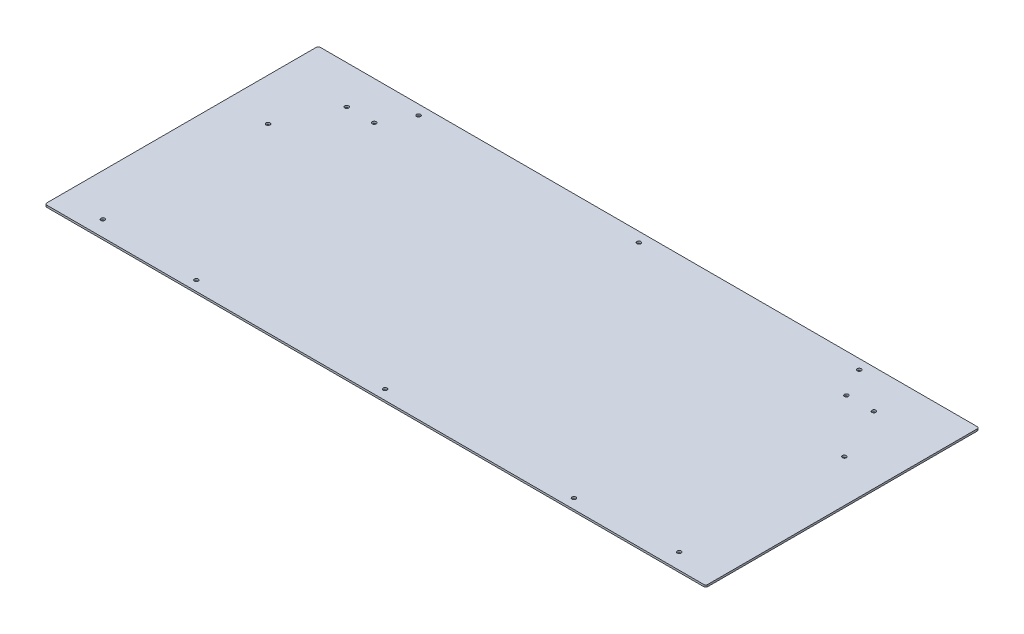
ISO-10303-21;
HEADER;
FILE_DESCRIPTION(('STEP AP214'),'2;1');
FILE_NAME('part.step','',(''),(''),'','','');
FILE_SCHEMA(('AUTOMOTIVE_DESIGN { 1 0 10303 214 1 1 1 1 }'));
ENDSEC;
DATA;
#1=APPLICATION_CONTEXT('core data for automotive mechanical design processes');
#2=APPLICATION_PROTOCOL_DEFINITION('international standard','automotive_design',2000,#1);
#3=PRODUCT_CONTEXT('',#1,'mechanical');
#4=PRODUCT('Part','Part','',(#3));
#5=PRODUCT_RELATED_PRODUCT_CATEGORY('part','',(#4));
#6=PRODUCT_DEFINITION_FORMATION('','',#4);
#7=PRODUCT_DEFINITION_CONTEXT('part definition',#1,'design');
#8=PRODUCT_DEFINITION('design','',#6,#7);
#9=PRODUCT_DEFINITION_SHAPE('','',#8);
#10=(LENGTH_UNIT() NAMED_UNIT(*) SI_UNIT(.MILLI.,.METRE.));
#11=(NAMED_UNIT(*) PLANE_ANGLE_UNIT() SI_UNIT($,.RADIAN.));
#12=(NAMED_UNIT(*) SI_UNIT($,.STERADIAN.) SOLID_ANGLE_UNIT());
#13=UNCERTAINTY_MEASURE_WITH_UNIT(LENGTH_MEASURE(1.E-05),#10,'distance_accuracy_value','');
#14=(GEOMETRIC_REPRESENTATION_CONTEXT(3) GLOBAL_UNCERTAINTY_ASSIGNED_CONTEXT((#13)) GLOBAL_UNIT_ASSIGNED_CONTEXT((#10,
#11,#12)) REPRESENTATION_CONTEXT('',''));
#15=CARTESIAN_POINT('',(0.,0.,0.));
#16=DIRECTION('',(0.,0.,1.));
#17=DIRECTION('',(1.,0.,0.));
#18=AXIS2_PLACEMENT_3D('',#15,#16,#17);
#19=CARTESIAN_POINT('',(0.,0.,0.));
#20=DIRECTION('',(0.,-1.,0.));
#21=DIRECTION('',(0.,0.,-1.));
#22=AXIS2_PLACEMENT_3D('',#19,#20,#21);
#23=PLANE('',#22);
#24=CARTESIAN_POINT('',(228.6,0.,-15.875));
#25=DIRECTION('',(0.,1.,0.));
#26=DIRECTION('',(0.,0.,1.));
#27=AXIS2_PLACEMENT_3D('',#24,#25,#26);
#28=CIRCLE('',#27,3.17499999999998);
#29=CARTESIAN_POINT('',(228.6,0.,-12.7));
#30=VERTEX_POINT('',#29);
#31=EDGE_CURVE('E250',#30,#30,#28,.T.);
#32=ORIENTED_EDGE('',*,*,#31,.T.);
#33=EDGE_LOOP('',(#32));
#34=FACE_BOUND('',#33,.T.);
#35=CARTESIAN_POINT('',(533.4,0.,-15.875));
#36=DIRECTION('',(0.,1.,0.));
#37=DIRECTION('',(0.,0.,1.));
#38=AXIS2_PLACEMENT_3D('',#35,#36,#37);
#39=CIRCLE('',#38,3.17500000000004);
#40=CARTESIAN_POINT('',(533.4,0.,-12.7));
#41=VERTEX_POINT('',#40);
#42=EDGE_CURVE('E244',#41,#41,#39,.T.);
#43=ORIENTED_EDGE('',*,*,#42,.T.);
#44=EDGE_LOOP('',(#43));
#45=FACE_BOUND('',#44,.T.);
#46=CARTESIAN_POINT('',(838.2,0.,-15.8750000000001));
#47=DIRECTION('',(0.,1.,0.));
#48=DIRECTION('',(0.,0.,1.));
#49=AXIS2_PLACEMENT_3D('',#46,#47,#48);
#50=CIRCLE('',#49,3.17500000000004);
#51=CARTESIAN_POINT('',(838.2,0.,-12.7000000000001));
#52=VERTEX_POINT('',#51);
#53=EDGE_CURVE('E238',#52,#52,#50,.T.);
#54=ORIENTED_EDGE('',*,*,#53,.T.);
#55=EDGE_LOOP('',(#54));
#56=FACE_BOUND('',#55,.T.);
#57=CARTESIAN_POINT('',(889.,0.,-425.45));
#58=DIRECTION('',(0.,1.,0.));
#59=DIRECTION('',(0.,0.,1.));
#60=AXIS2_PLACEMENT_3D('',#57,#58,#59);
#61=CIRCLE('',#60,3.17500000000004);
#62=CARTESIAN_POINT('',(889.,0.,-422.275));
#63=VERTEX_POINT('',#62);
#64=EDGE_CURVE('E232',#63,#63,#61,.T.);
#65=ORIENTED_EDGE('',*,*,#64,.T.);
#66=EDGE_LOOP('',(#65));
#67=FACE_BOUND('',#66,.T.);
#68=CARTESIAN_POINT('',(533.4,0.,-425.45));
#69=DIRECTION('',(0.,1.,0.));
#70=DIRECTION('',(0.,0.,1.));
#71=AXIS2_PLACEMENT_3D('',#68,#69,#70);
#72=CIRCLE('',#71,3.17500000000004);
#73=CARTESIAN_POINT('',(533.4,0.,-422.275));
#74=VERTEX_POINT('',#73);
#75=EDGE_CURVE('E226',#74,#74,#72,.T.);
#76=ORIENTED_EDGE('',*,*,#75,.T.);
#77=EDGE_LOOP('',(#76));
#78=FACE_BOUND('',#77,.T.);
#79=CARTESIAN_POINT('',(177.8,0.,-425.45));
#80=DIRECTION('',(0.,1.,0.));
#81=DIRECTION('',(0.,0.,1.));
#82=AXIS2_PLACEMENT_3D('',#79,#80,#81);
#83=CIRCLE('',#82,3.17499999999998);
#84=CARTESIAN_POINT('',(177.8,0.,-422.275));
#85=VERTEX_POINT('',#84);
#86=EDGE_CURVE('E220',#85,#85,#83,.T.);
#87=ORIENTED_EDGE('',*,*,#86,.T.);
#88=EDGE_LOOP('',(#87));
#89=FACE_BOUND('',#88,.T.);
#90=CARTESIAN_POINT('',(68.2624999999999,0.,-25.4));
#91=DIRECTION('',(0.,1.,0.));
#92=DIRECTION('',(0.,0.,1.));
#93=AXIS2_PLACEMENT_3D('',#90,#91,#92);
#94=CIRCLE('',#93,3.175);
#95=CARTESIAN_POINT('',(68.2624999999999,0.,-22.225));
#96=VERTEX_POINT('',#95);
#97=EDGE_CURVE('E214',#96,#96,#94,.T.);
#98=ORIENTED_EDGE('',*,*,#97,.T.);
#99=EDGE_LOOP('',(#98));
#100=FACE_BOUND('',#99,.T.);
#101=CARTESIAN_POINT('',(68.2625,0.,-292.1));
#102=DIRECTION('',(0.,1.,0.));
#103=DIRECTION('',(0.,0.,1.));
#104=AXIS2_PLACEMENT_3D('',#101,#102,#103);
#105=CIRCLE('',#104,3.175);
#106=CARTESIAN_POINT('',(68.2625,0.,-288.925));
#107=VERTEX_POINT('',#106);
#108=EDGE_CURVE('E208',#107,#107,#105,.T.);
#109=ORIENTED_EDGE('',*,*,#108,.T.);
#110=EDGE_LOOP('',(#109));
#111=FACE_BOUND('',#110,.T.);
#112=CARTESIAN_POINT('',(998.5375,0.,-25.4000000000001));
#113=DIRECTION('',(0.,1.,0.));
#114=DIRECTION('',(0.,0.,1.));
#115=AXIS2_PLACEMENT_3D('',#112,#113,#114);
#116=CIRCLE('',#115,3.17500000000004);
#117=CARTESIAN_POINT('',(998.5375,0.,-22.225));
#118=VERTEX_POINT('',#117);
#119=EDGE_CURVE('E202',#118,#118,#116,.T.);
#120=ORIENTED_EDGE('',*,*,#119,.T.);
#121=EDGE_LOOP('',(#120));
#122=FACE_BOUND('',#121,.T.);
#123=CARTESIAN_POINT('',(998.5375,0.,-292.1));
#124=DIRECTION('',(0.,1.,0.));
#125=DIRECTION('',(0.,0.,1.));
#126=AXIS2_PLACEMENT_3D('',#123,#124,#125);
#127=CIRCLE('',#126,3.17500000000004);
#128=CARTESIAN_POINT('',(998.5375,0.,-288.925));
#129=VERTEX_POINT('',#128);
#130=EDGE_CURVE('E196',#129,#129,#127,.T.);
#131=ORIENTED_EDGE('',*,*,#130,.T.);
#132=EDGE_LOOP('',(#131));
#133=FACE_BOUND('',#132,.T.);
#134=DIRECTION('',(-1.,0.,0.));
#135=VECTOR('',#134,1.);
#136=CARTESIAN_POINT('',(0.,0.,-441.325));
#137=LINE('',#136,#135);
#138=CARTESIAN_POINT('',(1063.625,0.,-441.325));
#139=VERTEX_POINT('',#138);
#140=CARTESIAN_POINT('',(3.175,0.,-441.325));
#141=VERTEX_POINT('',#140);
#142=EDGE_CURVE('E118',#139,#141,#137,.T.);
#143=ORIENTED_EDGE('',*,*,#142,.F.);
#144=CARTESIAN_POINT('',(1063.625,0.,-438.15));
#145=DIRECTION('',(0.,-1.,0.));
#146=DIRECTION('',(0.,0.,-1.));
#147=AXIS2_PLACEMENT_3D('',#144,#145,#146);
#148=CIRCLE('',#147,3.175);
#149=CARTESIAN_POINT('',(1066.8,0.,-438.15));
#150=VERTEX_POINT('',#149);
#151=EDGE_CURVE('E101',#139,#150,#148,.T.);
#152=ORIENTED_EDGE('',*,*,#151,.T.);
#153=DIRECTION('',(0.,0.,-1.));
#154=VECTOR('',#153,1.);
#155=CARTESIAN_POINT('',(1066.8,0.,0.));
#156=LINE('',#155,#154);
#157=CARTESIAN_POINT('',(1066.8,0.,-3.175));
#158=VERTEX_POINT('',#157);
#159=EDGE_CURVE('E128',#158,#150,#156,.T.);
#160=ORIENTED_EDGE('',*,*,#159,.F.);
#161=CARTESIAN_POINT('',(1063.625,0.,-3.175));
#162=DIRECTION('',(0.,-1.,0.));
#163=DIRECTION('',(0.,0.,-1.));
#164=AXIS2_PLACEMENT_3D('',#161,#162,#163);
#165=CIRCLE('',#164,3.175);
#166=CARTESIAN_POINT('',(1063.625,0.,0.));
#167=VERTEX_POINT('',#166);
#168=EDGE_CURVE('E112',#158,#167,#165,.T.);
#169=ORIENTED_EDGE('',*,*,#168,.T.);
#170=DIRECTION('',(1.,0.,0.));
#171=VECTOR('',#170,1.);
#172=CARTESIAN_POINT('',(0.,0.,0.));
#173=LINE('',#172,#171);
#174=CARTESIAN_POINT('',(3.175,0.,0.));
#175=VERTEX_POINT('',#174);
#176=EDGE_CURVE('E132',#175,#167,#173,.T.);
#177=ORIENTED_EDGE('',*,*,#176,.F.);
#178=CARTESIAN_POINT('',(3.175,0.,-3.175));
#179=DIRECTION('',(0.,-1.,0.));
#180=DIRECTION('',(0.,0.,-1.));
#181=AXIS2_PLACEMENT_3D('',#178,#179,#180);
#182=CIRCLE('',#181,3.175);
#183=CARTESIAN_POINT('',(0.,0.,-3.175));
#184=VERTEX_POINT('',#183);
#185=EDGE_CURVE('E138',#175,#184,#182,.T.);
#186=ORIENTED_EDGE('',*,*,#185,.T.);
#187=DIRECTION('',(0.,0.,1.));
#188=VECTOR('',#187,1.);
#189=CARTESIAN_POINT('',(0.,0.,0.));
#190=LINE('',#189,#188);
#191=CARTESIAN_POINT('',(0.,0.,-438.15));
#192=VERTEX_POINT('',#191);
#193=EDGE_CURVE('E160',#192,#184,#190,.T.);
#194=ORIENTED_EDGE('',*,*,#193,.F.);
#195=CARTESIAN_POINT('',(3.175,0.,-438.15));
#196=DIRECTION('',(0.,-1.,0.));
#197=DIRECTION('',(0.,0.,-1.));
#198=AXIS2_PLACEMENT_3D('',#195,#196,#197);
#199=CIRCLE('',#198,3.175);
#200=EDGE_CURVE('E122',#192,#141,#199,.T.);
#201=ORIENTED_EDGE('',*,*,#200,.T.);
#202=EDGE_LOOP('',(#143,#152,#160,#169,#177,#186,#194,#201));
#203=FACE_BOUND('',#202,.T.);
#204=CARTESIAN_POINT('',(152.4,0.,-379.3744));
#205=DIRECTION('',(0.,1.,0.));
#206=DIRECTION('',(0.,0.,1.));
#207=AXIS2_PLACEMENT_3D('',#204,#205,#206);
#208=CIRCLE('',#207,3.17499999999998);
#209=CARTESIAN_POINT('',(152.4,0.,-376.1994));
#210=VERTEX_POINT('',#209);
#211=EDGE_CURVE('E165',#210,#210,#208,.T.);
#212=ORIENTED_EDGE('',*,*,#211,.T.);
#213=EDGE_LOOP('',(#212));
#214=FACE_BOUND('',#213,.T.);
#215=CARTESIAN_POINT('',(107.95,0.,-379.3744));
#216=DIRECTION('',(0.,1.,0.));
#217=DIRECTION('',(0.,0.,1.));
#218=AXIS2_PLACEMENT_3D('',#215,#216,#217);
#219=CIRCLE('',#218,3.175);
#220=CARTESIAN_POINT('',(107.95,0.,-376.1994));
#221=VERTEX_POINT('',#220);
#222=EDGE_CURVE('E178',#221,#221,#219,.T.);
#223=ORIENTED_EDGE('',*,*,#222,.T.);
#224=EDGE_LOOP('',(#223));
#225=FACE_BOUND('',#224,.T.);
#226=CARTESIAN_POINT('',(914.4,0.,-379.3744));
#227=DIRECTION('',(0.,1.,0.));
#228=DIRECTION('',(0.,0.,1.));
#229=AXIS2_PLACEMENT_3D('',#226,#227,#228);
#230=CIRCLE('',#229,3.17500000000004);
#231=CARTESIAN_POINT('',(914.4,0.,-376.1994));
#232=VERTEX_POINT('',#231);
#233=EDGE_CURVE('E184',#232,#232,#230,.T.);
#234=ORIENTED_EDGE('',*,*,#233,.T.);
#235=EDGE_LOOP('',(#234));
#236=FACE_BOUND('',#235,.T.);
#237=CARTESIAN_POINT('',(958.85,0.,-379.3744));
#238=DIRECTION('',(0.,1.,0.));
#239=DIRECTION('',(0.,0.,1.));
#240=AXIS2_PLACEMENT_3D('',#237,#238,#239);
#241=CIRCLE('',#240,3.17500000000004);
#242=CARTESIAN_POINT('',(958.85,0.,-376.1994));
#243=VERTEX_POINT('',#242);
#244=EDGE_CURVE('E190',#243,#243,#241,.T.);
#245=ORIENTED_EDGE('',*,*,#244,.T.);
#246=EDGE_LOOP('',(#245));
#247=FACE_BOUND('',#246,.T.);
#248=ADVANCED_FACE('F35',(#34,#45,#56,#67,#78,#89,#100,#111,#122,#133,#203,#214,#225,#236,#247),
#23,.T.);
#249=CARTESIAN_POINT('',(0.,3.175,0.));
#250=DIRECTION('',(1.,0.,0.));
#251=DIRECTION('',(0.,0.,-1.));
#252=AXIS2_PLACEMENT_3D('',#249,#250,#251);
#253=PLANE('',#252);
#254=ORIENTED_EDGE('',*,*,#193,.T.);
#255=DIRECTION('',(0.,-1.,0.));
#256=VECTOR('',#255,1.);
#257=CARTESIAN_POINT('',(0.,3.175,-3.175));
#258=LINE('',#257,#256);
#259=CARTESIAN_POINT('',(0.,3.175,-3.175));
#260=VERTEX_POINT('',#259);
#261=EDGE_CURVE('E11',#184,#260,#258,.F.);
#262=ORIENTED_EDGE('',*,*,#261,.T.);
#263=DIRECTION('',(0.,0.,1.));
#264=VECTOR('',#263,1.);
#265=CARTESIAN_POINT('',(0.,3.175,0.));
#266=LINE('',#265,#264);
#267=CARTESIAN_POINT('',(0.,3.175,-438.15));
#268=VERTEX_POINT('',#267);
#269=EDGE_CURVE('E127',#268,#260,#266,.T.);
#270=ORIENTED_EDGE('',*,*,#269,.F.);
#271=DIRECTION('',(0.,-1.,0.));
#272=VECTOR('',#271,1.);
#273=CARTESIAN_POINT('',(0.,3.175,-438.15));
#274=LINE('',#273,#272);
#275=EDGE_CURVE('E43',#268,#192,#274,.T.);
#276=ORIENTED_EDGE('',*,*,#275,.T.);
#277=EDGE_LOOP('',(#254,#262,#270,#276));
#278=FACE_BOUND('',#277,.T.);
#279=ADVANCED_FACE('F159',(#278),#253,.F.);
#280=CARTESIAN_POINT('',(0.,3.175,0.));
#281=DIRECTION('',(0.,0.,-1.));
#282=DIRECTION('',(-1.,0.,0.));
#283=AXIS2_PLACEMENT_3D('',#280,#281,#282);
#284=PLANE('',#283);
#285=ORIENTED_EDGE('',*,*,#176,.T.);
#286=DIRECTION('',(0.,-1.,0.));
#287=VECTOR('',#286,1.);
#288=CARTESIAN_POINT('',(1063.625,3.175,0.));
#289=LINE('',#288,#287);
#290=CARTESIAN_POINT('',(1063.625,3.175,0.));
#291=VERTEX_POINT('',#290);
#292=EDGE_CURVE('E50',#167,#291,#289,.F.);
#293=ORIENTED_EDGE('',*,*,#292,.T.);
#294=DIRECTION('',(1.,0.,0.));
#295=VECTOR('',#294,1.);
#296=CARTESIAN_POINT('',(0.,3.175,0.));
#297=LINE('',#296,#295);
#298=CARTESIAN_POINT('',(3.175,3.175,0.));
#299=VERTEX_POINT('',#298);
#300=EDGE_CURVE('E130',#299,#291,#297,.T.);
#301=ORIENTED_EDGE('',*,*,#300,.F.);
#302=DIRECTION('',(0.,-1.,0.));
#303=VECTOR('',#302,1.);
#304=CARTESIAN_POINT('',(3.175,3.175,0.));
#305=LINE('',#304,#303);
#306=EDGE_CURVE('E151',#299,#175,#305,.T.);
#307=ORIENTED_EDGE('',*,*,#306,.T.);
#308=EDGE_LOOP('',(#285,#293,#301,#307));
#309=FACE_BOUND('',#308,.T.);
#310=ADVANCED_FACE('F296',(#309),#284,.F.);
#311=CARTESIAN_POINT('',(1066.8,3.175,0.));
#312=DIRECTION('',(-1.,0.,0.));
#313=DIRECTION('',(0.,0.,1.));
#314=AXIS2_PLACEMENT_3D('',#311,#312,#313);
#315=PLANE('',#314);
#316=ORIENTED_EDGE('',*,*,#159,.T.);
#317=DIRECTION('',(0.,-1.,0.));
#318=VECTOR('',#317,1.);
#319=CARTESIAN_POINT('',(1066.8,3.175,-438.15));
#320=LINE('',#319,#318);
#321=CARTESIAN_POINT('',(1066.8,3.175,-438.15));
#322=VERTEX_POINT('',#321);
#323=EDGE_CURVE('E106',#150,#322,#320,.F.);
#324=ORIENTED_EDGE('',*,*,#323,.T.);
#325=DIRECTION('',(0.,0.,-1.));
#326=VECTOR('',#325,1.);
#327=CARTESIAN_POINT('',(1066.8,3.175,0.));
#328=LINE('',#327,#326);
#329=CARTESIAN_POINT('',(1066.8,3.175,-3.175));
#330=VERTEX_POINT('',#329);
#331=EDGE_CURVE('E172',#330,#322,#328,.T.);
#332=ORIENTED_EDGE('',*,*,#331,.F.);
#333=DIRECTION('',(0.,-1.,0.));
#334=VECTOR('',#333,1.);
#335=CARTESIAN_POINT('',(1066.8,3.175,-3.175));
#336=LINE('',#335,#334);
#337=EDGE_CURVE('E111',#330,#158,#336,.T.);
#338=ORIENTED_EDGE('',*,*,#337,.T.);
#339=EDGE_LOOP('',(#316,#324,#332,#338));
#340=FACE_BOUND('',#339,.T.);
#341=ADVANCED_FACE('F293',(#340),#315,.F.);
#342=CARTESIAN_POINT('',(0.,3.175,-441.325));
#343=DIRECTION('',(0.,0.,1.));
#344=DIRECTION('',(1.,0.,0.));
#345=AXIS2_PLACEMENT_3D('',#342,#343,#344);
#346=PLANE('',#345);
#347=DIRECTION('',(-1.,0.,0.));
#348=VECTOR('',#347,1.);
#349=CARTESIAN_POINT('',(0.,3.175,-441.325));
#350=LINE('',#349,#348);
#351=CARTESIAN_POINT('',(1063.625,3.175,-441.325));
#352=VERTEX_POINT('',#351);
#353=CARTESIAN_POINT('',(3.175,3.175,-441.325));
#354=VERTEX_POINT('',#353);
#355=EDGE_CURVE('E121',#352,#354,#350,.T.);
#356=ORIENTED_EDGE('',*,*,#355,.F.);
#357=DIRECTION('',(0.,-1.,0.));
#358=VECTOR('',#357,1.);
#359=CARTESIAN_POINT('',(1063.625,3.175,-441.325));
#360=LINE('',#359,#358);
#361=EDGE_CURVE('E105',#352,#139,#360,.T.);
#362=ORIENTED_EDGE('',*,*,#361,.T.);
#363=ORIENTED_EDGE('',*,*,#142,.T.);
#364=DIRECTION('',(0.,-1.,0.));
#365=VECTOR('',#364,1.);
#366=CARTESIAN_POINT('',(3.175,3.175,-441.325));
#367=LINE('',#366,#365);
#368=EDGE_CURVE('E123',#141,#354,#367,.F.);
#369=ORIENTED_EDGE('',*,*,#368,.T.);
#370=EDGE_LOOP('',(#356,#362,#363,#369));
#371=FACE_BOUND('',#370,.T.);
#372=ADVANCED_FACE('F117',(#371),#346,.F.);
#373=CARTESIAN_POINT('',(0.,3.175,0.));
#374=DIRECTION('',(0.,-1.,0.));
#375=DIRECTION('',(0.,0.,-1.));
#376=AXIS2_PLACEMENT_3D('',#373,#374,#375);
#377=PLANE('',#376);
#378=CARTESIAN_POINT('',(228.6,3.175,-15.875));
#379=DIRECTION('',(0.,1.,0.));
#380=DIRECTION('',(0.,0.,1.));
#381=AXIS2_PLACEMENT_3D('',#378,#379,#380);
#382=CIRCLE('',#381,3.17499999999998);
#383=CARTESIAN_POINT('',(228.6,3.175,-12.7));
#384=VERTEX_POINT('',#383);
#385=EDGE_CURVE('E253',#384,#384,#382,.T.);
#386=ORIENTED_EDGE('',*,*,#385,.F.);
#387=EDGE_LOOP('',(#386));
#388=FACE_BOUND('',#387,.T.);
#389=CARTESIAN_POINT('',(533.4,3.175,-15.875));
#390=DIRECTION('',(0.,1.,0.));
#391=DIRECTION('',(0.,0.,1.));
#392=AXIS2_PLACEMENT_3D('',#389,#390,#391);
#393=CIRCLE('',#392,3.17500000000004);
#394=CARTESIAN_POINT('',(533.4,3.175,-12.7));
#395=VERTEX_POINT('',#394);
#396=EDGE_CURVE('E247',#395,#395,#393,.T.);
#397=ORIENTED_EDGE('',*,*,#396,.F.);
#398=EDGE_LOOP('',(#397));
#399=FACE_BOUND('',#398,.T.);
#400=CARTESIAN_POINT('',(838.2,3.175,-15.8750000000001));
#401=DIRECTION('',(0.,1.,0.));
#402=DIRECTION('',(0.,0.,1.));
#403=AXIS2_PLACEMENT_3D('',#400,#401,#402);
#404=CIRCLE('',#403,3.17500000000004);
#405=CARTESIAN_POINT('',(838.2,3.175,-12.7000000000001));
#406=VERTEX_POINT('',#405);
#407=EDGE_CURVE('E241',#406,#406,#404,.T.);
#408=ORIENTED_EDGE('',*,*,#407,.F.);
#409=EDGE_LOOP('',(#408));
#410=FACE_BOUND('',#409,.T.);
#411=CARTESIAN_POINT('',(889.,3.175,-425.45));
#412=DIRECTION('',(0.,1.,0.));
#413=DIRECTION('',(0.,0.,1.));
#414=AXIS2_PLACEMENT_3D('',#411,#412,#413);
#415=CIRCLE('',#414,3.17500000000004);
#416=CARTESIAN_POINT('',(889.,3.175,-422.275));
#417=VERTEX_POINT('',#416);
#418=EDGE_CURVE('E235',#417,#417,#415,.T.);
#419=ORIENTED_EDGE('',*,*,#418,.F.);
#420=EDGE_LOOP('',(#419));
#421=FACE_BOUND('',#420,.T.);
#422=CARTESIAN_POINT('',(533.4,3.175,-425.45));
#423=DIRECTION('',(0.,1.,0.));
#424=DIRECTION('',(0.,0.,1.));
#425=AXIS2_PLACEMENT_3D('',#422,#423,#424);
#426=CIRCLE('',#425,3.17500000000004);
#427=CARTESIAN_POINT('',(533.4,3.175,-422.275));
#428=VERTEX_POINT('',#427);
#429=EDGE_CURVE('E229',#428,#428,#426,.T.);
#430=ORIENTED_EDGE('',*,*,#429,.F.);
#431=EDGE_LOOP('',(#430));
#432=FACE_BOUND('',#431,.T.);
#433=CARTESIAN_POINT('',(177.8,3.175,-425.45));
#434=DIRECTION('',(0.,1.,0.));
#435=DIRECTION('',(0.,0.,1.));
#436=AXIS2_PLACEMENT_3D('',#433,#434,#435);
#437=CIRCLE('',#436,3.17499999999998);
#438=CARTESIAN_POINT('',(177.8,3.175,-422.275));
#439=VERTEX_POINT('',#438);
#440=EDGE_CURVE('E223',#439,#439,#437,.T.);
#441=ORIENTED_EDGE('',*,*,#440,.F.);
#442=EDGE_LOOP('',(#441));
#443=FACE_BOUND('',#442,.T.);
#444=CARTESIAN_POINT('',(68.2624999999999,3.175,-25.4));
#445=DIRECTION('',(0.,1.,0.));
#446=DIRECTION('',(0.,0.,1.));
#447=AXIS2_PLACEMENT_3D('',#444,#445,#446);
#448=CIRCLE('',#447,3.17499999999998);
#449=CARTESIAN_POINT('',(68.2624999999999,3.175,-22.225));
#450=VERTEX_POINT('',#449);
#451=EDGE_CURVE('E217',#450,#450,#448,.T.);
#452=ORIENTED_EDGE('',*,*,#451,.F.);
#453=EDGE_LOOP('',(#452));
#454=FACE_BOUND('',#453,.T.);
#455=CARTESIAN_POINT('',(68.2625,3.175,-292.1));
#456=DIRECTION('',(0.,1.,0.));
#457=DIRECTION('',(0.,0.,1.));
#458=AXIS2_PLACEMENT_3D('',#455,#456,#457);
#459=CIRCLE('',#458,3.17499999999998);
#460=CARTESIAN_POINT('',(68.2625,3.175,-288.925));
#461=VERTEX_POINT('',#460);
#462=EDGE_CURVE('E211',#461,#461,#459,.T.);
#463=ORIENTED_EDGE('',*,*,#462,.F.);
#464=EDGE_LOOP('',(#463));
#465=FACE_BOUND('',#464,.T.);
#466=CARTESIAN_POINT('',(998.5375,3.175,-25.4000000000001));
#467=DIRECTION('',(0.,1.,0.));
#468=DIRECTION('',(0.,0.,1.));
#469=AXIS2_PLACEMENT_3D('',#466,#467,#468);
#470=CIRCLE('',#469,3.17500000000004);
#471=CARTESIAN_POINT('',(998.5375,3.175,-22.225));
#472=VERTEX_POINT('',#471);
#473=EDGE_CURVE('E205',#472,#472,#470,.T.);
#474=ORIENTED_EDGE('',*,*,#473,.F.);
#475=EDGE_LOOP('',(#474));
#476=FACE_BOUND('',#475,.T.);
#477=CARTESIAN_POINT('',(998.5375,3.175,-292.1));
#478=DIRECTION('',(0.,1.,0.));
#479=DIRECTION('',(0.,0.,1.));
#480=AXIS2_PLACEMENT_3D('',#477,#478,#479);
#481=CIRCLE('',#480,3.17500000000004);
#482=CARTESIAN_POINT('',(998.5375,3.175,-288.925));
#483=VERTEX_POINT('',#482);
#484=EDGE_CURVE('E199',#483,#483,#481,.T.);
#485=ORIENTED_EDGE('',*,*,#484,.F.);
#486=EDGE_LOOP('',(#485));
#487=FACE_BOUND('',#486,.T.);
#488=CARTESIAN_POINT('',(958.85,3.175,-379.3744));
#489=DIRECTION('',(0.,1.,0.));
#490=DIRECTION('',(0.,0.,1.));
#491=AXIS2_PLACEMENT_3D('',#488,#489,#490);
#492=CIRCLE('',#491,3.17500000000004);
#493=CARTESIAN_POINT('',(958.85,3.175,-376.1994));
#494=VERTEX_POINT('',#493);
#495=EDGE_CURVE('E193',#494,#494,#492,.T.);
#496=ORIENTED_EDGE('',*,*,#495,.F.);
#497=EDGE_LOOP('',(#496));
#498=FACE_BOUND('',#497,.T.);
#499=CARTESIAN_POINT('',(914.4,3.175,-379.3744));
#500=DIRECTION('',(0.,1.,0.));
#501=DIRECTION('',(0.,0.,1.));
#502=AXIS2_PLACEMENT_3D('',#499,#500,#501);
#503=CIRCLE('',#502,3.17500000000004);
#504=CARTESIAN_POINT('',(914.4,3.175,-376.1994));
#505=VERTEX_POINT('',#504);
#506=EDGE_CURVE('E187',#505,#505,#503,.T.);
#507=ORIENTED_EDGE('',*,*,#506,.F.);
#508=EDGE_LOOP('',(#507));
#509=FACE_BOUND('',#508,.T.);
#510=CARTESIAN_POINT('',(107.95,3.175,-379.3744));
#511=DIRECTION('',(0.,1.,0.));
#512=DIRECTION('',(0.,0.,1.));
#513=AXIS2_PLACEMENT_3D('',#510,#511,#512);
#514=CIRCLE('',#513,3.17499999999998);
#515=CARTESIAN_POINT('',(107.95,3.175,-376.1994));
#516=VERTEX_POINT('',#515);
#517=EDGE_CURVE('E181',#516,#516,#514,.T.);
#518=ORIENTED_EDGE('',*,*,#517,.F.);
#519=EDGE_LOOP('',(#518));
#520=FACE_BOUND('',#519,.T.);
#521=CARTESIAN_POINT('',(152.4,3.175,-379.3744));
#522=DIRECTION('',(0.,1.,0.));
#523=DIRECTION('',(0.,0.,1.));
#524=AXIS2_PLACEMENT_3D('',#521,#522,#523);
#525=CIRCLE('',#524,3.17499999999998);
#526=CARTESIAN_POINT('',(152.4,3.175,-376.1994));
#527=VERTEX_POINT('',#526);
#528=EDGE_CURVE('E168',#527,#527,#525,.T.);
#529=ORIENTED_EDGE('',*,*,#528,.F.);
#530=EDGE_LOOP('',(#529));
#531=FACE_BOUND('',#530,.T.);
#532=ORIENTED_EDGE('',*,*,#331,.T.);
#533=CARTESIAN_POINT('',(1063.625,3.175,-438.15));
#534=DIRECTION('',(0.,-1.,0.));
#535=DIRECTION('',(0.,0.,-1.));
#536=AXIS2_PLACEMENT_3D('',#533,#534,#535);
#537=CIRCLE('',#536,3.175);
#538=EDGE_CURVE('E149',#322,#352,#537,.F.);
#539=ORIENTED_EDGE('',*,*,#538,.T.);
#540=ORIENTED_EDGE('',*,*,#355,.T.);
#541=CARTESIAN_POINT('',(3.175,3.175,-438.15));
#542=DIRECTION('',(0.,-1.,0.));
#543=DIRECTION('',(0.,0.,-1.));
#544=AXIS2_PLACEMENT_3D('',#541,#542,#543);
#545=CIRCLE('',#544,3.175);
#546=EDGE_CURVE('E144',#354,#268,#545,.F.);
#547=ORIENTED_EDGE('',*,*,#546,.T.);
#548=ORIENTED_EDGE('',*,*,#269,.T.);
#549=CARTESIAN_POINT('',(3.175,3.175,-3.175));
#550=DIRECTION('',(0.,-1.,0.));
#551=DIRECTION('',(0.,0.,-1.));
#552=AXIS2_PLACEMENT_3D('',#549,#550,#551);
#553=CIRCLE('',#552,3.175);
#554=EDGE_CURVE('E57',#260,#299,#553,.F.);
#555=ORIENTED_EDGE('',*,*,#554,.T.);
#556=ORIENTED_EDGE('',*,*,#300,.T.);
#557=CARTESIAN_POINT('',(1063.625,3.175,-3.175));
#558=DIRECTION('',(0.,-1.,0.));
#559=DIRECTION('',(0.,0.,-1.));
#560=AXIS2_PLACEMENT_3D('',#557,#558,#559);
#561=CIRCLE('',#560,3.175);
#562=EDGE_CURVE('E147',#291,#330,#561,.F.);
#563=ORIENTED_EDGE('',*,*,#562,.T.);
#564=EDGE_LOOP('',(#532,#539,#540,#547,#548,#555,#556,#563));
#565=FACE_BOUND('',#564,.T.);
#566=ADVANCED_FACE('F259',(#388,#399,#410,#421,#432,#443,#454,#465,#476,#487,#498,#509,#520,
#531,#565),#377,.F.);
#567=CARTESIAN_POINT('',(152.4,3.175,-379.3744));
#568=DIRECTION('',(0.,1.,0.));
#569=DIRECTION('',(0.,0.,1.));
#570=AXIS2_PLACEMENT_3D('',#567,#568,#569);
#571=CYLINDRICAL_SURFACE('',#570,3.17499999999998);
#572=ORIENTED_EDGE('',*,*,#211,.F.);
#573=EDGE_LOOP('',(#572));
#574=FACE_BOUND('',#573,.T.);
#575=ORIENTED_EDGE('',*,*,#528,.T.);
#576=EDGE_LOOP('',(#575));
#577=FACE_BOUND('',#576,.T.);
#578=ADVANCED_FACE('F262',(#574,#577),#571,.F.);
#579=CARTESIAN_POINT('',(107.95,3.175,-379.3744));
#580=DIRECTION('',(0.,1.,0.));
#581=DIRECTION('',(0.,0.,1.));
#582=AXIS2_PLACEMENT_3D('',#579,#580,#581);
#583=CYLINDRICAL_SURFACE('',#582,3.17499999999999);
#584=ORIENTED_EDGE('',*,*,#222,.F.);
#585=EDGE_LOOP('',(#584));
#586=FACE_BOUND('',#585,.T.);
#587=ORIENTED_EDGE('',*,*,#517,.T.);
#588=EDGE_LOOP('',(#587));
#589=FACE_BOUND('',#588,.T.);
#590=ADVANCED_FACE('F451',(#586,#589),#583,.F.);
#591=CARTESIAN_POINT('',(914.4,3.175,-379.3744));
#592=DIRECTION('',(0.,1.,0.));
#593=DIRECTION('',(0.,0.,1.));
#594=AXIS2_PLACEMENT_3D('',#591,#592,#593);
#595=CYLINDRICAL_SURFACE('',#594,3.17500000000004);
#596=ORIENTED_EDGE('',*,*,#233,.F.);
#597=EDGE_LOOP('',(#596));
#598=FACE_BOUND('',#597,.T.);
#599=ORIENTED_EDGE('',*,*,#506,.T.);
#600=EDGE_LOOP('',(#599));
#601=FACE_BOUND('',#600,.T.);
#602=ADVANCED_FACE('F442',(#598,#601),#595,.F.);
#603=CARTESIAN_POINT('',(958.85,3.175,-379.3744));
#604=DIRECTION('',(0.,1.,0.));
#605=DIRECTION('',(0.,0.,1.));
#606=AXIS2_PLACEMENT_3D('',#603,#604,#605);
#607=CYLINDRICAL_SURFACE('',#606,3.17500000000004);
#608=ORIENTED_EDGE('',*,*,#244,.F.);
#609=EDGE_LOOP('',(#608));
#610=FACE_BOUND('',#609,.T.);
#611=ORIENTED_EDGE('',*,*,#495,.T.);
#612=EDGE_LOOP('',(#611));
#613=FACE_BOUND('',#612,.T.);
#614=ADVANCED_FACE('F433',(#610,#613),#607,.F.);
#615=CARTESIAN_POINT('',(998.5375,3.175,-292.1));
#616=DIRECTION('',(0.,1.,0.));
#617=DIRECTION('',(0.,0.,1.));
#618=AXIS2_PLACEMENT_3D('',#615,#616,#617);
#619=CYLINDRICAL_SURFACE('',#618,3.17500000000004);
#620=ORIENTED_EDGE('',*,*,#130,.F.);
#621=EDGE_LOOP('',(#620));
#622=FACE_BOUND('',#621,.T.);
#623=ORIENTED_EDGE('',*,*,#484,.T.);
#624=EDGE_LOOP('',(#623));
#625=FACE_BOUND('',#624,.T.);
#626=ADVANCED_FACE('F424',(#622,#625),#619,.F.);
#627=CARTESIAN_POINT('',(998.5375,3.175,-25.4000000000001));
#628=DIRECTION('',(0.,1.,0.));
#629=DIRECTION('',(0.,0.,1.));
#630=AXIS2_PLACEMENT_3D('',#627,#628,#629);
#631=CYLINDRICAL_SURFACE('',#630,3.17500000000004);
#632=ORIENTED_EDGE('',*,*,#119,.F.);
#633=EDGE_LOOP('',(#632));
#634=FACE_BOUND('',#633,.T.);
#635=ORIENTED_EDGE('',*,*,#473,.T.);
#636=EDGE_LOOP('',(#635));
#637=FACE_BOUND('',#636,.T.);
#638=ADVANCED_FACE('F415',(#634,#637),#631,.F.);
#639=CARTESIAN_POINT('',(68.2625,3.175,-292.1));
#640=DIRECTION('',(0.,1.,0.));
#641=DIRECTION('',(0.,0.,1.));
#642=AXIS2_PLACEMENT_3D('',#639,#640,#641);
#643=CYLINDRICAL_SURFACE('',#642,3.17499999999999);
#644=ORIENTED_EDGE('',*,*,#108,.F.);
#645=EDGE_LOOP('',(#644));
#646=FACE_BOUND('',#645,.T.);
#647=ORIENTED_EDGE('',*,*,#462,.T.);
#648=EDGE_LOOP('',(#647));
#649=FACE_BOUND('',#648,.T.);
#650=ADVANCED_FACE('F406',(#646,#649),#643,.F.);
#651=CARTESIAN_POINT('',(68.2624999999999,3.175,-25.4));
#652=DIRECTION('',(0.,1.,0.));
#653=DIRECTION('',(0.,0.,1.));
#654=AXIS2_PLACEMENT_3D('',#651,#652,#653);
#655=CYLINDRICAL_SURFACE('',#654,3.17499999999999);
#656=ORIENTED_EDGE('',*,*,#97,.F.);
#657=EDGE_LOOP('',(#656));
#658=FACE_BOUND('',#657,.T.);
#659=ORIENTED_EDGE('',*,*,#451,.T.);
#660=EDGE_LOOP('',(#659));
#661=FACE_BOUND('',#660,.T.);
#662=ADVANCED_FACE('F397',(#658,#661),#655,.F.);
#663=CARTESIAN_POINT('',(177.8,3.175,-425.45));
#664=DIRECTION('',(0.,1.,0.));
#665=DIRECTION('',(0.,0.,1.));
#666=AXIS2_PLACEMENT_3D('',#663,#664,#665);
#667=CYLINDRICAL_SURFACE('',#666,3.17499999999998);
#668=ORIENTED_EDGE('',*,*,#86,.F.);
#669=EDGE_LOOP('',(#668));
#670=FACE_BOUND('',#669,.T.);
#671=ORIENTED_EDGE('',*,*,#440,.T.);
#672=EDGE_LOOP('',(#671));
#673=FACE_BOUND('',#672,.T.);
#674=ADVANCED_FACE('F388',(#670,#673),#667,.F.);
#675=CARTESIAN_POINT('',(533.4,3.175,-425.45));
#676=DIRECTION('',(0.,1.,0.));
#677=DIRECTION('',(0.,0.,1.));
#678=AXIS2_PLACEMENT_3D('',#675,#676,#677);
#679=CYLINDRICAL_SURFACE('',#678,3.17500000000004);
#680=ORIENTED_EDGE('',*,*,#75,.F.);
#681=EDGE_LOOP('',(#680));
#682=FACE_BOUND('',#681,.T.);
#683=ORIENTED_EDGE('',*,*,#429,.T.);
#684=EDGE_LOOP('',(#683));
#685=FACE_BOUND('',#684,.T.);
#686=ADVANCED_FACE('F379',(#682,#685),#679,.F.);
#687=CARTESIAN_POINT('',(889.,3.175,-425.45));
#688=DIRECTION('',(0.,1.,0.));
#689=DIRECTION('',(0.,0.,1.));
#690=AXIS2_PLACEMENT_3D('',#687,#688,#689);
#691=CYLINDRICAL_SURFACE('',#690,3.17500000000004);
#692=ORIENTED_EDGE('',*,*,#64,.F.);
#693=EDGE_LOOP('',(#692));
#694=FACE_BOUND('',#693,.T.);
#695=ORIENTED_EDGE('',*,*,#418,.T.);
#696=EDGE_LOOP('',(#695));
#697=FACE_BOUND('',#696,.T.);
#698=ADVANCED_FACE('F370',(#694,#697),#691,.F.);
#699=CARTESIAN_POINT('',(838.2,3.175,-15.8750000000001));
#700=DIRECTION('',(0.,1.,0.));
#701=DIRECTION('',(0.,0.,1.));
#702=AXIS2_PLACEMENT_3D('',#699,#700,#701);
#703=CYLINDRICAL_SURFACE('',#702,3.17500000000004);
#704=ORIENTED_EDGE('',*,*,#53,.F.);
#705=EDGE_LOOP('',(#704));
#706=FACE_BOUND('',#705,.T.);
#707=ORIENTED_EDGE('',*,*,#407,.T.);
#708=EDGE_LOOP('',(#707));
#709=FACE_BOUND('',#708,.T.);
#710=ADVANCED_FACE('F361',(#706,#709),#703,.F.);
#711=CARTESIAN_POINT('',(533.4,3.175,-15.875));
#712=DIRECTION('',(0.,1.,0.));
#713=DIRECTION('',(0.,0.,1.));
#714=AXIS2_PLACEMENT_3D('',#711,#712,#713);
#715=CYLINDRICAL_SURFACE('',#714,3.17500000000004);
#716=ORIENTED_EDGE('',*,*,#42,.F.);
#717=EDGE_LOOP('',(#716));
#718=FACE_BOUND('',#717,.T.);
#719=ORIENTED_EDGE('',*,*,#396,.T.);
#720=EDGE_LOOP('',(#719));
#721=FACE_BOUND('',#720,.T.);
#722=ADVANCED_FACE('F352',(#718,#721),#715,.F.);
#723=CARTESIAN_POINT('',(228.6,3.175,-15.875));
#724=DIRECTION('',(0.,1.,0.));
#725=DIRECTION('',(0.,0.,1.));
#726=AXIS2_PLACEMENT_3D('',#723,#724,#725);
#727=CYLINDRICAL_SURFACE('',#726,3.17499999999998);
#728=ORIENTED_EDGE('',*,*,#31,.F.);
#729=EDGE_LOOP('',(#728));
#730=FACE_BOUND('',#729,.T.);
#731=ORIENTED_EDGE('',*,*,#385,.T.);
#732=EDGE_LOOP('',(#731));
#733=FACE_BOUND('',#732,.T.);
#734=ADVANCED_FACE('F257',(#730,#733),#727,.F.);
#735=CARTESIAN_POINT('',(1063.625,3.175,-438.15));
#736=DIRECTION('',(0.,-1.,0.));
#737=DIRECTION('',(0.,0.,-1.));
#738=AXIS2_PLACEMENT_3D('',#735,#736,#737);
#739=CYLINDRICAL_SURFACE('',#738,3.175);
#740=ORIENTED_EDGE('',*,*,#538,.F.);
#741=ORIENTED_EDGE('',*,*,#323,.F.);
#742=ORIENTED_EDGE('',*,*,#151,.F.);
#743=ORIENTED_EDGE('',*,*,#361,.F.);
#744=EDGE_LOOP('',(#740,#741,#742,#743));
#745=FACE_BOUND('',#744,.T.);
#746=ADVANCED_FACE('F104',(#745),#739,.T.);
#747=CARTESIAN_POINT('',(1063.625,3.175,-3.175));
#748=DIRECTION('',(0.,-1.,0.));
#749=DIRECTION('',(0.,0.,-1.));
#750=AXIS2_PLACEMENT_3D('',#747,#748,#749);
#751=CYLINDRICAL_SURFACE('',#750,3.175);
#752=ORIENTED_EDGE('',*,*,#562,.F.);
#753=ORIENTED_EDGE('',*,*,#292,.F.);
#754=ORIENTED_EDGE('',*,*,#168,.F.);
#755=ORIENTED_EDGE('',*,*,#337,.F.);
#756=EDGE_LOOP('',(#752,#753,#754,#755));
#757=FACE_BOUND('',#756,.T.);
#758=ADVANCED_FACE('F295',(#757),#751,.T.);
#759=CARTESIAN_POINT('',(3.175,3.175,-3.175));
#760=DIRECTION('',(0.,-1.,0.));
#761=DIRECTION('',(0.,0.,-1.));
#762=AXIS2_PLACEMENT_3D('',#759,#760,#761);
#763=CYLINDRICAL_SURFACE('',#762,3.175);
#764=ORIENTED_EDGE('',*,*,#554,.F.);
#765=ORIENTED_EDGE('',*,*,#261,.F.);
#766=ORIENTED_EDGE('',*,*,#185,.F.);
#767=ORIENTED_EDGE('',*,*,#306,.F.);
#768=EDGE_LOOP('',(#764,#765,#766,#767));
#769=FACE_BOUND('',#768,.T.);
#770=ADVANCED_FACE('F299',(#769),#763,.T.);
#771=CARTESIAN_POINT('',(3.175,3.175,-438.15));
#772=DIRECTION('',(0.,-1.,0.));
#773=DIRECTION('',(0.,0.,-1.));
#774=AXIS2_PLACEMENT_3D('',#771,#772,#773);
#775=CYLINDRICAL_SURFACE('',#774,3.175);
#776=ORIENTED_EDGE('',*,*,#546,.F.);
#777=ORIENTED_EDGE('',*,*,#368,.F.);
#778=ORIENTED_EDGE('',*,*,#200,.F.);
#779=ORIENTED_EDGE('',*,*,#275,.F.);
#780=EDGE_LOOP('',(#776,#777,#778,#779));
#781=FACE_BOUND('',#780,.T.);
#782=ADVANCED_FACE('F37',(#781),#775,.T.);
#783=CLOSED_SHELL('',(#248,#279,#310,#341,#372,#566,#578,#590,#602,#614,#626,#638,#650,#662,
#674,#686,#698,#710,#722,#734,#746,#758,#770,#782));
#784=MANIFOLD_SOLID_BREP('B2',#783);
#785=ADVANCED_BREP_SHAPE_REPRESENTATION('',(#18,#784),#14);
#786=SHAPE_DEFINITION_REPRESENTATION(#9,#785);
ENDSEC;
END-ISO-10303-21;
